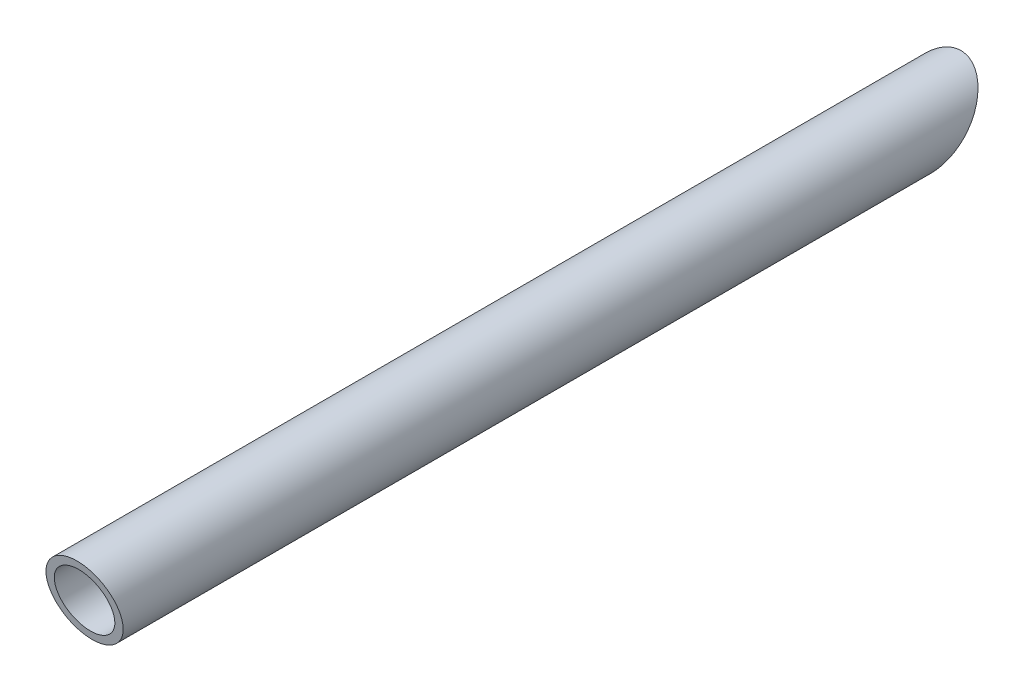
ISO-10303-21;
HEADER;
FILE_DESCRIPTION(('STEP AP214'),'2;1');
FILE_NAME('part.step','',(''),(''),'','','');
FILE_SCHEMA(('AUTOMOTIVE_DESIGN { 1 0 10303 214 1 1 1 1 }'));
ENDSEC;
DATA;
#1=APPLICATION_CONTEXT('core data for automotive mechanical design processes');
#2=APPLICATION_PROTOCOL_DEFINITION('international standard','automotive_design',2000,#1);
#3=PRODUCT_CONTEXT('',#1,'mechanical');
#4=PRODUCT('Part','Part','',(#3));
#5=PRODUCT_RELATED_PRODUCT_CATEGORY('part','',(#4));
#6=PRODUCT_DEFINITION_FORMATION('','',#4);
#7=PRODUCT_DEFINITION_CONTEXT('part definition',#1,'design');
#8=PRODUCT_DEFINITION('design','',#6,#7);
#9=PRODUCT_DEFINITION_SHAPE('','',#8);
#10=(LENGTH_UNIT() NAMED_UNIT(*) SI_UNIT(.MILLI.,.METRE.));
#11=(NAMED_UNIT(*) PLANE_ANGLE_UNIT() SI_UNIT($,.RADIAN.));
#12=(NAMED_UNIT(*) SI_UNIT($,.STERADIAN.) SOLID_ANGLE_UNIT());
#13=UNCERTAINTY_MEASURE_WITH_UNIT(LENGTH_MEASURE(1.E-05),#10,'distance_accuracy_value','');
#14=(GEOMETRIC_REPRESENTATION_CONTEXT(3) GLOBAL_UNCERTAINTY_ASSIGNED_CONTEXT((#13)) GLOBAL_UNIT_ASSIGNED_CONTEXT((#10,
#11,#12)) REPRESENTATION_CONTEXT('',''));
#15=CARTESIAN_POINT('',(0.,0.,0.));
#16=DIRECTION('',(0.,0.,1.));
#17=DIRECTION('',(1.,0.,0.));
#18=AXIS2_PLACEMENT_3D('',#15,#16,#17);
#19=CARTESIAN_POINT('',(0.,0.,0.));
#20=DIRECTION('',(0.,0.,1.));
#21=DIRECTION('',(-1.,0.,0.));
#22=AXIS2_PLACEMENT_3D('',#19,#20,#21);
#23=CYLINDRICAL_SURFACE('',#22,10.65);
#24=CARTESIAN_POINT('',(0.,0.,0.));
#25=DIRECTION('',(3.63358247758646E-07,0.66276269212888,0.748829495894725));
#26=DIRECTION('',(0.,-0.748829495894774,0.662762692128924));
#27=AXIS2_PLACEMENT_3D('',#24,#25,#26);
#28=ELLIPSE('',#27,14.2221961853604,10.6500000000013);
#29=CARTESIAN_POINT('',(5.83883892844446E-06,10.6499979868165,-9.42593925));
#30=VERTEX_POINT('',#29);
#31=EDGE_CURVE('E11',#30,#30,#28,.T.);
#32=ORIENTED_EDGE('',*,*,#31,.T.);
#33=EDGE_LOOP('',(#32));
#34=FACE_BOUND('',#33,.T.);
#35=CARTESIAN_POINT('',(0.,0.,237.450516701438));
#36=DIRECTION('',(-0.00107297405787232,0.1963006783918,-0.980543161920775));
#37=DIRECTION('',(-0.00535954163611363,0.98052851447729,0.196303610793102));
#38=AXIS2_PLACEMENT_3D('',#35,#36,#37);
#39=ELLIPSE('',#38,10.8613270823671,10.65);
#40=CARTESIAN_POINT('',(0.0582117347213939,-10.6498409093254,235.318398977164));
#41=VERTEX_POINT('',#40);
#42=EDGE_CURVE('E52',#41,#41,#39,.T.);
#43=ORIENTED_EDGE('',*,*,#42,.T.);
#44=EDGE_LOOP('',(#43));
#45=FACE_BOUND('',#44,.T.);
#46=ADVANCED_FACE('F16',(#34,#45),#23,.T.);
#47=CARTESIAN_POINT('',(0.,0.,0.));
#48=DIRECTION('',(0.,0.,1.));
#49=DIRECTION('',(-1.,0.,0.));
#50=AXIS2_PLACEMENT_3D('',#47,#48,#49);
#51=CYLINDRICAL_SURFACE('',#50,8.35);
#52=CARTESIAN_POINT('',(0.,0.,0.));
#53=DIRECTION('',(-3.63358247758646E-07,-0.66276269212888,-0.748829495894725));
#54=DIRECTION('',(0.,-0.748829495894774,0.662762692128924));
#55=AXIS2_PLACEMENT_3D('',#52,#53,#54);
#56=ELLIPSE('',#55,11.1507359763154,8.35000000000099);
#57=CARTESIAN_POINT('',(0.,8.35,-7.39029179488166));
#58=VERTEX_POINT('',#57);
#59=EDGE_CURVE('E20',#58,#58,#56,.T.);
#60=ORIENTED_EDGE('',*,*,#59,.T.);
#61=EDGE_LOOP('',(#60));
#62=FACE_BOUND('',#61,.T.);
#63=CARTESIAN_POINT('',(0.,0.,237.450516701438));
#64=DIRECTION('',(0.00107297405787232,-0.1963006783918,0.980543161920775));
#65=DIRECTION('',(-0.00535954163611363,0.98052851447729,0.196303610793102));
#66=AXIS2_PLACEMENT_3D('',#63,#64,#65);
#67=ELLIPSE('',#66,8.51568836974324,8.35);
#68=CARTESIAN_POINT('',(0.0456401863778085,-8.34987526693588,235.778856326068));
#69=VERTEX_POINT('',#68);
#70=EDGE_CURVE('E45',#69,#69,#67,.T.);
#71=ORIENTED_EDGE('',*,*,#70,.T.);
#72=EDGE_LOOP('',(#71));
#73=FACE_BOUND('',#72,.T.);
#74=ADVANCED_FACE('F78',(#62,#73),#51,.F.);
#75=CARTESIAN_POINT('',(0.,0.,0.));
#76=DIRECTION('',(3.63358247758646E-07,0.66276269212888,0.748829495894725));
#77=DIRECTION('',(0.99999999999985,-5.48247890344336E-07,0.));
#78=AXIS2_PLACEMENT_3D('',#75,#76,#77);
#79=PLANE('',#78);
#80=ORIENTED_EDGE('',*,*,#31,.F.);
#81=EDGE_LOOP('',(#80));
#82=FACE_BOUND('',#81,.T.);
#83=ORIENTED_EDGE('',*,*,#59,.F.);
#84=EDGE_LOOP('',(#83));
#85=FACE_BOUND('',#84,.T.);
#86=ADVANCED_FACE('F73',(#82,#85),#79,.F.);
#87=CARTESIAN_POINT('',(0.249821065400666,-45.7047812618678,228.3003354882));
#88=DIRECTION('',(-0.00107297405787232,0.1963006783918,-0.980543161920775));
#89=DIRECTION('',(-0.999999401292598,0.,0.00109426433954521));
#90=AXIS2_PLACEMENT_3D('',#87,#88,#89);
#91=PLANE('',#90);
#92=ORIENTED_EDGE('',*,*,#42,.F.);
#93=EDGE_LOOP('',(#92));
#94=FACE_BOUND('',#93,.T.);
#95=ORIENTED_EDGE('',*,*,#70,.F.);
#96=EDGE_LOOP('',(#95));
#97=FACE_BOUND('',#96,.T.);
#98=ADVANCED_FACE('F18',(#94,#97),#91,.F.);
#99=CLOSED_SHELL('',(#46,#74,#86,#98));
#100=MANIFOLD_SOLID_BREP('B1',#99);
#101=ADVANCED_BREP_SHAPE_REPRESENTATION('',(#18,#100),#14);
#102=SHAPE_DEFINITION_REPRESENTATION(#9,#101);
ENDSEC;
END-ISO-10303-21;
